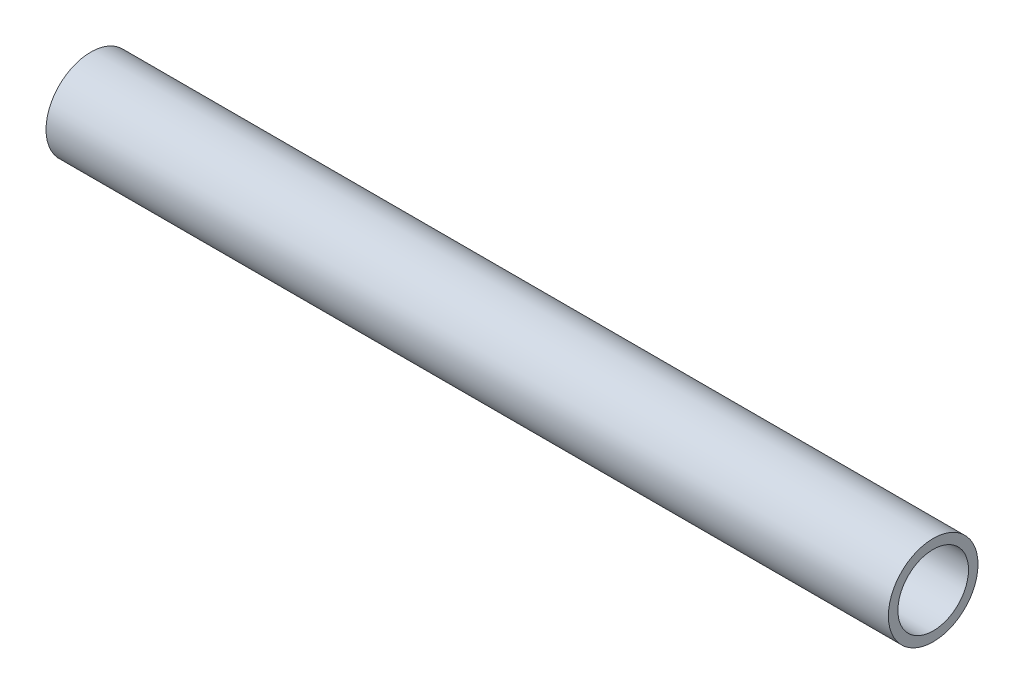
ISO-10303-21;
HEADER;
FILE_DESCRIPTION(('STEP AP214'),'2;1');
FILE_NAME('part.step','',(''),(''),'','','');
FILE_SCHEMA(('AUTOMOTIVE_DESIGN { 1 0 10303 214 1 1 1 1 }'));
ENDSEC;
DATA;
#1=APPLICATION_CONTEXT('core data for automotive mechanical design processes');
#2=APPLICATION_PROTOCOL_DEFINITION('international standard','automotive_design',2000,#1);
#3=PRODUCT_CONTEXT('',#1,'mechanical');
#4=PRODUCT('Part','Part','',(#3));
#5=PRODUCT_RELATED_PRODUCT_CATEGORY('part','',(#4));
#6=PRODUCT_DEFINITION_FORMATION('','',#4);
#7=PRODUCT_DEFINITION_CONTEXT('part definition',#1,'design');
#8=PRODUCT_DEFINITION('design','',#6,#7);
#9=PRODUCT_DEFINITION_SHAPE('','',#8);
#10=(LENGTH_UNIT() NAMED_UNIT(*) SI_UNIT(.MILLI.,.METRE.));
#11=(NAMED_UNIT(*) PLANE_ANGLE_UNIT() SI_UNIT($,.RADIAN.));
#12=(NAMED_UNIT(*) SI_UNIT($,.STERADIAN.) SOLID_ANGLE_UNIT());
#13=UNCERTAINTY_MEASURE_WITH_UNIT(LENGTH_MEASURE(1.E-05),#10,'distance_accuracy_value','');
#14=(GEOMETRIC_REPRESENTATION_CONTEXT(3) GLOBAL_UNCERTAINTY_ASSIGNED_CONTEXT((#13)) GLOBAL_UNIT_ASSIGNED_CONTEXT((#10,
#11,#12)) REPRESENTATION_CONTEXT('',''));
#15=CARTESIAN_POINT('',(0.,0.,0.));
#16=DIRECTION('',(0.,0.,1.));
#17=DIRECTION('',(1.,0.,0.));
#18=AXIS2_PLACEMENT_3D('',#15,#16,#17);
#19=CARTESIAN_POINT('',(203.2,0.,0.));
#20=DIRECTION('',(1.,0.,0.));
#21=DIRECTION('',(0.,0.,-1.));
#22=AXIS2_PLACEMENT_3D('',#19,#20,#21);
#23=PLANE('',#22);
#24=CARTESIAN_POINT('',(203.2,0.,0.));
#25=DIRECTION('',(1.,0.,0.));
#26=DIRECTION('',(0.,0.,-1.));
#27=AXIS2_PLACEMENT_3D('',#24,#25,#26);
#28=CIRCLE('',#27,10.795);
#29=CARTESIAN_POINT('',(203.2,0.,-10.795));
#30=VERTEX_POINT('',#29);
#31=EDGE_CURVE('E42',#30,#30,#28,.T.);
#32=ORIENTED_EDGE('',*,*,#31,.T.);
#33=EDGE_LOOP('',(#32));
#34=FACE_BOUND('',#33,.T.);
#35=CARTESIAN_POINT('',(203.2,0.,0.));
#36=DIRECTION('',(1.,0.,0.));
#37=DIRECTION('',(0.,0.,-1.));
#38=AXIS2_PLACEMENT_3D('',#35,#36,#37);
#39=CIRCLE('',#38,8.509);
#40=CARTESIAN_POINT('',(203.2,0.,-8.509));
#41=VERTEX_POINT('',#40);
#42=EDGE_CURVE('E46',#41,#41,#39,.T.);
#43=ORIENTED_EDGE('',*,*,#42,.F.);
#44=EDGE_LOOP('',(#43));
#45=FACE_BOUND('',#44,.T.);
#46=ADVANCED_FACE('F31',(#34,#45),#23,.T.);
#47=CARTESIAN_POINT('',(203.2,0.,0.));
#48=DIRECTION('',(-1.,0.,0.));
#49=DIRECTION('',(0.,0.,1.));
#50=AXIS2_PLACEMENT_3D('',#47,#48,#49);
#51=CYLINDRICAL_SURFACE('',#50,10.795);
#52=CARTESIAN_POINT('',(0.254000000000043,0.,0.));
#53=DIRECTION('',(-1.,0.,0.));
#54=DIRECTION('',(0.,0.,1.));
#55=AXIS2_PLACEMENT_3D('',#52,#53,#54);
#56=CIRCLE('',#55,10.795);
#57=CARTESIAN_POINT('',(0.254000000000043,0.,10.795));
#58=VERTEX_POINT('',#57);
#59=EDGE_CURVE('E38',#58,#58,#56,.F.);
#60=ORIENTED_EDGE('',*,*,#59,.T.);
#61=EDGE_LOOP('',(#60));
#62=FACE_BOUND('',#61,.T.);
#63=ORIENTED_EDGE('',*,*,#31,.F.);
#64=EDGE_LOOP('',(#63));
#65=FACE_BOUND('',#64,.T.);
#66=ADVANCED_FACE('F55',(#62,#65),#51,.T.);
#67=CARTESIAN_POINT('',(203.2,0.,0.));
#68=DIRECTION('',(-1.,0.,0.));
#69=DIRECTION('',(0.,0.,1.));
#70=AXIS2_PLACEMENT_3D('',#67,#68,#69);
#71=CYLINDRICAL_SURFACE('',#70,8.509);
#72=CARTESIAN_POINT('',(2.54000000000001,0.,0.));
#73=DIRECTION('',(1.,0.,0.));
#74=DIRECTION('',(0.,0.,-1.));
#75=AXIS2_PLACEMENT_3D('',#72,#73,#74);
#76=CIRCLE('',#75,8.509);
#77=CARTESIAN_POINT('',(2.54000000000001,0.,-8.509));
#78=VERTEX_POINT('',#77);
#79=EDGE_CURVE('E10',#78,#78,#76,.F.);
#80=ORIENTED_EDGE('',*,*,#79,.T.);
#81=EDGE_LOOP('',(#80));
#82=FACE_BOUND('',#81,.T.);
#83=ORIENTED_EDGE('',*,*,#42,.T.);
#84=EDGE_LOOP('',(#83));
#85=FACE_BOUND('',#84,.T.);
#86=ADVANCED_FACE('F52',(#82,#85),#71,.F.);
#87=CARTESIAN_POINT('',(0.,0.,0.));
#88=DIRECTION('',(-1.,0.,0.));
#89=DIRECTION('',(0.,0.,1.));
#90=AXIS2_PLACEMENT_3D('',#87,#88,#89);
#91=CONICAL_SURFACE('',#90,11.049,0.785398163397454);
#92=ORIENTED_EDGE('',*,*,#79,.F.);
#93=EDGE_LOOP('',(#92));
#94=FACE_BOUND('',#93,.T.);
#95=ORIENTED_EDGE('',*,*,#59,.F.);
#96=EDGE_LOOP('',(#95));
#97=FACE_BOUND('',#96,.T.);
#98=ADVANCED_FACE('F33',(#94,#97),#91,.F.);
#99=CLOSED_SHELL('',(#46,#66,#86,#98));
#100=MANIFOLD_SOLID_BREP('B2',#99);
#101=ADVANCED_BREP_SHAPE_REPRESENTATION('',(#18,#100),#14);
#102=SHAPE_DEFINITION_REPRESENTATION(#9,#101);
ENDSEC;
END-ISO-10303-21;
